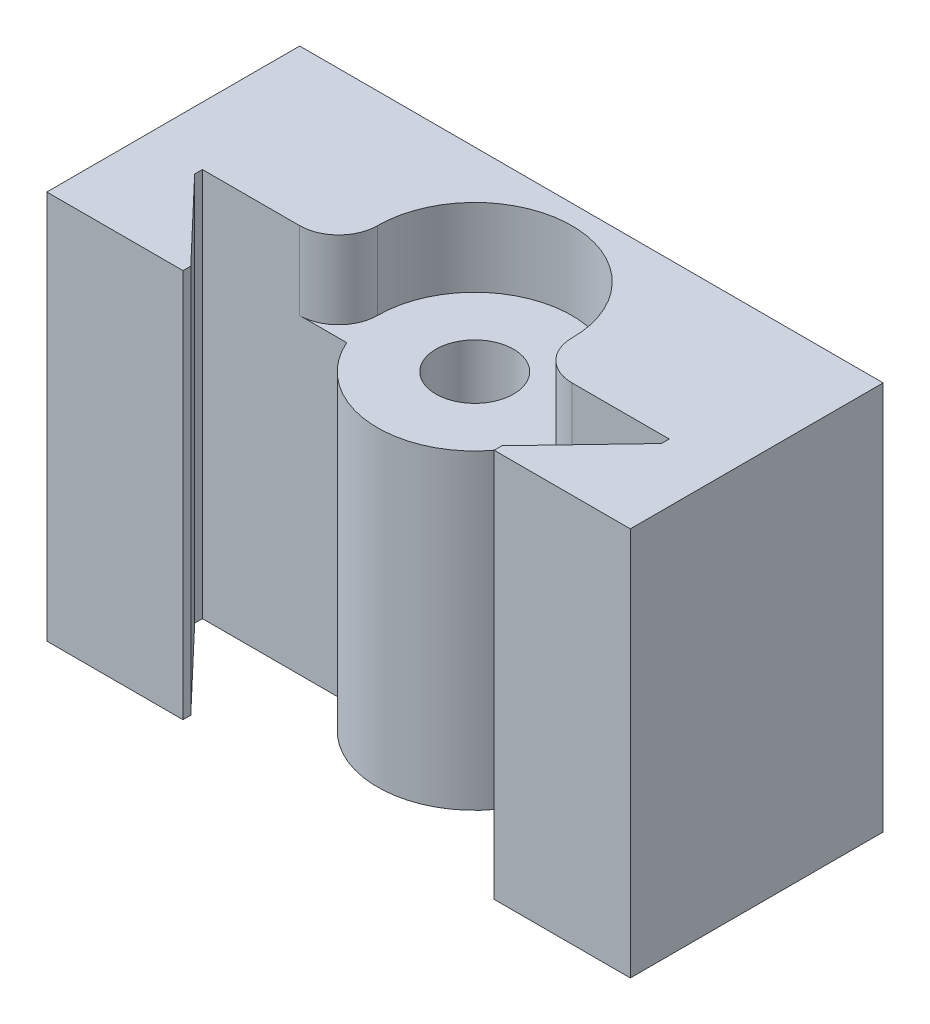
ISO-10303-21;
HEADER;
FILE_DESCRIPTION(('STEP AP214'),'2;1');
FILE_NAME('part.step','',(''),(''),'','','');
FILE_SCHEMA(('AUTOMOTIVE_DESIGN { 1 0 10303 214 1 1 1 1 }'));
ENDSEC;
DATA;
#1=APPLICATION_CONTEXT('core data for automotive mechanical design processes');
#2=APPLICATION_PROTOCOL_DEFINITION('international standard','automotive_design',2000,#1);
#3=PRODUCT_CONTEXT('',#1,'mechanical');
#4=PRODUCT('Part','Part','',(#3));
#5=PRODUCT_RELATED_PRODUCT_CATEGORY('part','',(#4));
#6=PRODUCT_DEFINITION_FORMATION('','',#4);
#7=PRODUCT_DEFINITION_CONTEXT('part definition',#1,'design');
#8=PRODUCT_DEFINITION('design','',#6,#7);
#9=PRODUCT_DEFINITION_SHAPE('','',#8);
#10=(LENGTH_UNIT() NAMED_UNIT(*) SI_UNIT(.MILLI.,.METRE.));
#11=(NAMED_UNIT(*) PLANE_ANGLE_UNIT() SI_UNIT($,.RADIAN.));
#12=(NAMED_UNIT(*) SI_UNIT($,.STERADIAN.) SOLID_ANGLE_UNIT());
#13=UNCERTAINTY_MEASURE_WITH_UNIT(LENGTH_MEASURE(1.E-05),#10,'distance_accuracy_value','');
#14=(GEOMETRIC_REPRESENTATION_CONTEXT(3) GLOBAL_UNCERTAINTY_ASSIGNED_CONTEXT((#13)) GLOBAL_UNIT_ASSIGNED_CONTEXT((#10,
#11,#12)) REPRESENTATION_CONTEXT('',''));
#15=CARTESIAN_POINT('',(0.,0.,0.));
#16=DIRECTION('',(0.,0.,1.));
#17=DIRECTION('',(1.,0.,0.));
#18=AXIS2_PLACEMENT_3D('',#15,#16,#17);
#19=CARTESIAN_POINT('',(7.,20.,-7.));
#20=DIRECTION('',(0.,-1.,0.));
#21=DIRECTION('',(0.,0.,-1.));
#22=AXIS2_PLACEMENT_3D('',#19,#20,#21);
#23=CYLINDRICAL_SURFACE('',#22,2.);
#24=DIRECTION('',(0.,-1.,0.));
#25=VECTOR('',#24,1.);
#26=CARTESIAN_POINT('',(5.,20.,-7.));
#27=LINE('',#26,#25);
#28=CARTESIAN_POINT('',(5.,20.,-7.));
#29=VERTEX_POINT('',#28);
#30=CARTESIAN_POINT('',(5.,16.,-7.));
#31=VERTEX_POINT('',#30);
#32=EDGE_CURVE('E64',#29,#31,#27,.T.);
#33=ORIENTED_EDGE('',*,*,#32,.T.);
#34=CARTESIAN_POINT('',(7.,16.,-7.));
#35=DIRECTION('',(0.,1.,0.));
#36=DIRECTION('',(0.,0.,1.));
#37=AXIS2_PLACEMENT_3D('',#34,#35,#36);
#38=CIRCLE('',#37,2.);
#39=CARTESIAN_POINT('',(7.,16.,-5.));
#40=VERTEX_POINT('',#39);
#41=EDGE_CURVE('E375',#31,#40,#38,.T.);
#42=ORIENTED_EDGE('',*,*,#41,.T.);
#43=DIRECTION('',(0.,-1.,0.));
#44=VECTOR('',#43,1.);
#45=CARTESIAN_POINT('',(7.,20.,-5.));
#46=LINE('',#45,#44);
#47=CARTESIAN_POINT('',(7.,20.,-5.));
#48=VERTEX_POINT('',#47);
#49=EDGE_CURVE('E11',#48,#40,#46,.T.);
#50=ORIENTED_EDGE('',*,*,#49,.F.);
#51=CARTESIAN_POINT('',(7.,20.,-7.));
#52=DIRECTION('',(0.,1.,0.));
#53=DIRECTION('',(0.,0.,1.));
#54=AXIS2_PLACEMENT_3D('',#51,#52,#53);
#55=CIRCLE('',#54,2.);
#56=EDGE_CURVE('E343',#29,#48,#55,.T.);
#57=ORIENTED_EDGE('',*,*,#56,.F.);
#58=EDGE_LOOP('',(#33,#42,#50,#57));
#59=FACE_BOUND('',#58,.T.);
#60=ADVANCED_FACE('F47',(#59),#23,.T.);
#61=CARTESIAN_POINT('',(0.,20.,-5.));
#62=DIRECTION('',(0.,0.,-1.));
#63=DIRECTION('',(-1.,0.,0.));
#64=AXIS2_PLACEMENT_3D('',#61,#62,#63);
#65=PLANE('',#64);
#66=DIRECTION('',(1.,0.,0.));
#67=VECTOR('',#66,1.);
#68=CARTESIAN_POINT('',(0.,0.,-5.));
#69=LINE('',#68,#67);
#70=CARTESIAN_POINT('',(4.58257569495584,0.,-5.));
#71=VERTEX_POINT('',#70);
#72=CARTESIAN_POINT('',(12.,0.,-5.));
#73=VERTEX_POINT('',#72);
#74=EDGE_CURVE('E197',#71,#73,#69,.T.);
#75=ORIENTED_EDGE('',*,*,#74,.T.);
#76=DIRECTION('',(0.,-1.,0.));
#77=VECTOR('',#76,1.);
#78=CARTESIAN_POINT('',(12.,20.,-5.));
#79=LINE('',#78,#77);
#80=CARTESIAN_POINT('',(12.,20.,-5.));
#81=VERTEX_POINT('',#80);
#82=EDGE_CURVE('E56',#81,#73,#79,.T.);
#83=ORIENTED_EDGE('',*,*,#82,.F.);
#84=DIRECTION('',(1.,0.,0.));
#85=VECTOR('',#84,1.);
#86=CARTESIAN_POINT('',(0.,20.,-5.));
#87=LINE('',#86,#85);
#88=EDGE_CURVE('E123',#48,#81,#87,.T.);
#89=ORIENTED_EDGE('',*,*,#88,.F.);
#90=ORIENTED_EDGE('',*,*,#49,.T.);
#91=DIRECTION('',(1.,0.,0.));
#92=VECTOR('',#91,1.);
#93=CARTESIAN_POINT('',(0.,16.,-5.));
#94=LINE('',#93,#92);
#95=CARTESIAN_POINT('',(4.58257569495584,16.,-5.));
#96=VERTEX_POINT('',#95);
#97=EDGE_CURVE('E379',#96,#40,#94,.T.);
#98=ORIENTED_EDGE('',*,*,#97,.F.);
#99=DIRECTION('',(0.,-1.,0.));
#100=VECTOR('',#99,1.);
#101=CARTESIAN_POINT('',(4.58257569495584,16.,-5.));
#102=LINE('',#101,#100);
#103=EDGE_CURVE('E201',#96,#71,#102,.T.);
#104=ORIENTED_EDGE('',*,*,#103,.T.);
#105=EDGE_LOOP('',(#75,#83,#89,#90,#98,#104));
#106=FACE_BOUND('',#105,.T.);
#107=ADVANCED_FACE('F397',(#106),#65,.F.);
#108=CARTESIAN_POINT('',(12.,20.,0.));
#109=DIRECTION('',(1.,0.,0.));
#110=DIRECTION('',(0.,0.,-1.));
#111=AXIS2_PLACEMENT_3D('',#108,#109,#110);
#112=PLANE('',#111);
#113=DIRECTION('',(0.,0.,1.));
#114=VECTOR('',#113,1.);
#115=CARTESIAN_POINT('',(12.,0.,0.));
#116=LINE('',#115,#114);
#117=CARTESIAN_POINT('',(12.,0.,-4.6));
#118=VERTEX_POINT('',#117);
#119=EDGE_CURVE('E200',#73,#118,#116,.T.);
#120=ORIENTED_EDGE('',*,*,#119,.T.);
#121=DIRECTION('',(0.,-1.,0.));
#122=VECTOR('',#121,1.);
#123=CARTESIAN_POINT('',(12.,20.,-4.6));
#124=LINE('',#123,#122);
#125=CARTESIAN_POINT('',(12.,20.,-4.6));
#126=VERTEX_POINT('',#125);
#127=EDGE_CURVE('E277',#126,#118,#124,.T.);
#128=ORIENTED_EDGE('',*,*,#127,.F.);
#129=DIRECTION('',(0.,0.,1.));
#130=VECTOR('',#129,1.);
#131=CARTESIAN_POINT('',(12.,20.,0.));
#132=LINE('',#131,#130);
#133=EDGE_CURVE('E287',#81,#126,#132,.T.);
#134=ORIENTED_EDGE('',*,*,#133,.F.);
#135=ORIENTED_EDGE('',*,*,#82,.T.);
#136=EDGE_LOOP('',(#120,#128,#134,#135));
#137=FACE_BOUND('',#136,.T.);
#138=ADVANCED_FACE('F285',(#137),#112,.F.);
#139=CARTESIAN_POINT('',(3.99524375743163,20.,3.80499405469679));
#140=DIRECTION('',(0.724137931034483,0.,0.689655172413793));
#141=DIRECTION('',(0.689655172413793,0.,-0.724137931034483));
#142=AXIS2_PLACEMENT_3D('',#139,#140,#141);
#143=PLANE('',#142);
#144=DIRECTION('',(-0.689655172413793,0.,0.724137931034483));
#145=VECTOR('',#144,1.);
#146=CARTESIAN_POINT('',(3.99524375743163,0.,3.80499405469679));
#147=LINE('',#146,#145);
#148=CARTESIAN_POINT('',(8.,0.,-0.399999999999999));
#149=VERTEX_POINT('',#148);
#150=EDGE_CURVE('E205',#118,#149,#147,.T.);
#151=ORIENTED_EDGE('',*,*,#150,.T.);
#152=DIRECTION('',(0.,-1.,0.));
#153=VECTOR('',#152,1.);
#154=CARTESIAN_POINT('',(8.,20.,-0.399999999999999));
#155=LINE('',#154,#153);
#156=CARTESIAN_POINT('',(8.,20.,-0.399999999999999));
#157=VERTEX_POINT('',#156);
#158=EDGE_CURVE('E274',#157,#149,#155,.T.);
#159=ORIENTED_EDGE('',*,*,#158,.F.);
#160=DIRECTION('',(-0.689655172413793,0.,0.724137931034483));
#161=VECTOR('',#160,1.);
#162=CARTESIAN_POINT('',(3.99524375743163,20.,3.80499405469679));
#163=LINE('',#162,#161);
#164=EDGE_CURVE('E303',#126,#157,#163,.T.);
#165=ORIENTED_EDGE('',*,*,#164,.F.);
#166=ORIENTED_EDGE('',*,*,#127,.T.);
#167=EDGE_LOOP('',(#151,#159,#165,#166));
#168=FACE_BOUND('',#167,.T.);
#169=ADVANCED_FACE('F300',(#168),#143,.F.);
#170=CARTESIAN_POINT('',(8.,20.,0.));
#171=DIRECTION('',(-1.,0.,0.));
#172=DIRECTION('',(0.,0.,1.));
#173=AXIS2_PLACEMENT_3D('',#170,#171,#172);
#174=PLANE('',#173);
#175=DIRECTION('',(0.,0.,-1.));
#176=VECTOR('',#175,1.);
#177=CARTESIAN_POINT('',(8.,0.,0.));
#178=LINE('',#177,#176);
#179=CARTESIAN_POINT('',(8.,0.,0.));
#180=VERTEX_POINT('',#179);
#181=EDGE_CURVE('E209',#180,#149,#178,.T.);
#182=ORIENTED_EDGE('',*,*,#181,.F.);
#183=DIRECTION('',(0.,-1.,0.));
#184=VECTOR('',#183,1.);
#185=CARTESIAN_POINT('',(8.,20.,0.));
#186=LINE('',#185,#184);
#187=CARTESIAN_POINT('',(8.,20.,0.));
#188=VERTEX_POINT('',#187);
#189=EDGE_CURVE('E271',#188,#180,#186,.T.);
#190=ORIENTED_EDGE('',*,*,#189,.F.);
#191=DIRECTION('',(0.,0.,-1.));
#192=VECTOR('',#191,1.);
#193=CARTESIAN_POINT('',(8.,20.,0.));
#194=LINE('',#193,#192);
#195=EDGE_CURVE('E306',#188,#157,#194,.T.);
#196=ORIENTED_EDGE('',*,*,#195,.T.);
#197=ORIENTED_EDGE('',*,*,#158,.T.);
#198=EDGE_LOOP('',(#182,#190,#196,#197));
#199=FACE_BOUND('',#198,.T.);
#200=ADVANCED_FACE('F452',(#199),#174,.T.);
#201=CARTESIAN_POINT('',(0.,20.,0.));
#202=DIRECTION('',(0.,0.,-1.));
#203=DIRECTION('',(-1.,0.,0.));
#204=AXIS2_PLACEMENT_3D('',#201,#202,#203);
#205=PLANE('',#204);
#206=DIRECTION('',(1.,0.,0.));
#207=VECTOR('',#206,1.);
#208=CARTESIAN_POINT('',(0.,0.,0.));
#209=LINE('',#208,#207);
#210=CARTESIAN_POINT('',(15.,0.,0.));
#211=VERTEX_POINT('',#210);
#212=EDGE_CURVE('E213',#180,#211,#209,.T.);
#213=ORIENTED_EDGE('',*,*,#212,.T.);
#214=DIRECTION('',(0.,-1.,0.));
#215=VECTOR('',#214,1.);
#216=CARTESIAN_POINT('',(15.,20.,0.));
#217=LINE('',#216,#215);
#218=CARTESIAN_POINT('',(15.,20.,0.));
#219=VERTEX_POINT('',#218);
#220=EDGE_CURVE('E267',#219,#211,#217,.T.);
#221=ORIENTED_EDGE('',*,*,#220,.F.);
#222=DIRECTION('',(1.,0.,0.));
#223=VECTOR('',#222,1.);
#224=CARTESIAN_POINT('',(0.,20.,0.));
#225=LINE('',#224,#223);
#226=EDGE_CURVE('E310',#188,#219,#225,.T.);
#227=ORIENTED_EDGE('',*,*,#226,.F.);
#228=ORIENTED_EDGE('',*,*,#189,.T.);
#229=EDGE_LOOP('',(#213,#221,#227,#228));
#230=FACE_BOUND('',#229,.T.);
#231=ADVANCED_FACE('F448',(#230),#205,.F.);
#232=CARTESIAN_POINT('',(15.,20.,0.));
#233=DIRECTION('',(-1.,0.,0.));
#234=DIRECTION('',(0.,0.,1.));
#235=AXIS2_PLACEMENT_3D('',#232,#233,#234);
#236=PLANE('',#235);
#237=DIRECTION('',(0.,0.,-1.));
#238=VECTOR('',#237,1.);
#239=CARTESIAN_POINT('',(15.,0.,0.));
#240=LINE('',#239,#238);
#241=CARTESIAN_POINT('',(15.,0.,-13.));
#242=VERTEX_POINT('',#241);
#243=EDGE_CURVE('E216',#211,#242,#240,.T.);
#244=ORIENTED_EDGE('',*,*,#243,.T.);
#245=DIRECTION('',(0.,-1.,0.));
#246=VECTOR('',#245,1.);
#247=CARTESIAN_POINT('',(15.,20.,-13.));
#248=LINE('',#247,#246);
#249=CARTESIAN_POINT('',(15.,20.,-13.));
#250=VERTEX_POINT('',#249);
#251=EDGE_CURVE('E263',#250,#242,#248,.T.);
#252=ORIENTED_EDGE('',*,*,#251,.F.);
#253=DIRECTION('',(0.,0.,-1.));
#254=VECTOR('',#253,1.);
#255=CARTESIAN_POINT('',(15.,20.,0.));
#256=LINE('',#255,#254);
#257=EDGE_CURVE('E316',#219,#250,#256,.T.);
#258=ORIENTED_EDGE('',*,*,#257,.F.);
#259=ORIENTED_EDGE('',*,*,#220,.T.);
#260=EDGE_LOOP('',(#244,#252,#258,#259));
#261=FACE_BOUND('',#260,.T.);
#262=ADVANCED_FACE('F444',(#261),#236,.F.);
#263=CARTESIAN_POINT('',(0.,20.,-13.));
#264=DIRECTION('',(0.,0.,1.));
#265=DIRECTION('',(1.,0.,0.));
#266=AXIS2_PLACEMENT_3D('',#263,#264,#265);
#267=PLANE('',#266);
#268=DIRECTION('',(-1.,0.,0.));
#269=VECTOR('',#268,1.);
#270=CARTESIAN_POINT('',(0.,0.,-13.));
#271=LINE('',#270,#269);
#272=CARTESIAN_POINT('',(-15.,0.,-13.));
#273=VERTEX_POINT('',#272);
#274=EDGE_CURVE('E219',#242,#273,#271,.T.);
#275=ORIENTED_EDGE('',*,*,#274,.T.);
#276=DIRECTION('',(0.,-1.,0.));
#277=VECTOR('',#276,1.);
#278=CARTESIAN_POINT('',(-15.,20.,-13.));
#279=LINE('',#278,#277);
#280=CARTESIAN_POINT('',(-15.,20.,-13.));
#281=VERTEX_POINT('',#280);
#282=EDGE_CURVE('E260',#281,#273,#279,.T.);
#283=ORIENTED_EDGE('',*,*,#282,.F.);
#284=DIRECTION('',(-1.,0.,0.));
#285=VECTOR('',#284,1.);
#286=CARTESIAN_POINT('',(0.,20.,-13.));
#287=LINE('',#286,#285);
#288=EDGE_CURVE('E319',#250,#281,#287,.T.);
#289=ORIENTED_EDGE('',*,*,#288,.F.);
#290=ORIENTED_EDGE('',*,*,#251,.T.);
#291=EDGE_LOOP('',(#275,#283,#289,#290));
#292=FACE_BOUND('',#291,.T.);
#293=ADVANCED_FACE('F440',(#292),#267,.F.);
#294=CARTESIAN_POINT('',(-15.,20.,0.));
#295=DIRECTION('',(-1.,0.,0.));
#296=DIRECTION('',(0.,0.,1.));
#297=AXIS2_PLACEMENT_3D('',#294,#295,#296);
#298=PLANE('',#297);
#299=DIRECTION('',(0.,0.,-1.));
#300=VECTOR('',#299,1.);
#301=CARTESIAN_POINT('',(-15.,0.,0.));
#302=LINE('',#301,#300);
#303=CARTESIAN_POINT('',(-15.,0.,0.));
#304=VERTEX_POINT('',#303);
#305=EDGE_CURVE('E223',#304,#273,#302,.T.);
#306=ORIENTED_EDGE('',*,*,#305,.F.);
#307=DIRECTION('',(0.,-1.,0.));
#308=VECTOR('',#307,1.);
#309=CARTESIAN_POINT('',(-15.,20.,0.));
#310=LINE('',#309,#308);
#311=CARTESIAN_POINT('',(-15.,20.,0.));
#312=VERTEX_POINT('',#311);
#313=EDGE_CURVE('E257',#312,#304,#310,.T.);
#314=ORIENTED_EDGE('',*,*,#313,.F.);
#315=DIRECTION('',(0.,0.,-1.));
#316=VECTOR('',#315,1.);
#317=CARTESIAN_POINT('',(-15.,20.,0.));
#318=LINE('',#317,#316);
#319=EDGE_CURVE('E322',#312,#281,#318,.T.);
#320=ORIENTED_EDGE('',*,*,#319,.T.);
#321=ORIENTED_EDGE('',*,*,#282,.T.);
#322=EDGE_LOOP('',(#306,#314,#320,#321));
#323=FACE_BOUND('',#322,.T.);
#324=ADVANCED_FACE('F436',(#323),#298,.T.);
#325=CARTESIAN_POINT('',(0.,20.,0.));
#326=DIRECTION('',(0.,0.,1.));
#327=DIRECTION('',(1.,0.,0.));
#328=AXIS2_PLACEMENT_3D('',#325,#326,#327);
#329=PLANE('',#328);
#330=DIRECTION('',(-1.,0.,0.));
#331=VECTOR('',#330,1.);
#332=CARTESIAN_POINT('',(0.,0.,0.));
#333=LINE('',#332,#331);
#334=CARTESIAN_POINT('',(-8.,0.,0.));
#335=VERTEX_POINT('',#334);
#336=EDGE_CURVE('E227',#335,#304,#333,.T.);
#337=ORIENTED_EDGE('',*,*,#336,.F.);
#338=DIRECTION('',(0.,-1.,0.));
#339=VECTOR('',#338,1.);
#340=CARTESIAN_POINT('',(-8.,20.,0.));
#341=LINE('',#340,#339);
#342=CARTESIAN_POINT('',(-8.,20.,0.));
#343=VERTEX_POINT('',#342);
#344=EDGE_CURVE('E254',#343,#335,#341,.T.);
#345=ORIENTED_EDGE('',*,*,#344,.F.);
#346=DIRECTION('',(-1.,0.,0.));
#347=VECTOR('',#346,1.);
#348=CARTESIAN_POINT('',(0.,20.,0.));
#349=LINE('',#348,#347);
#350=EDGE_CURVE('E326',#343,#312,#349,.T.);
#351=ORIENTED_EDGE('',*,*,#350,.T.);
#352=ORIENTED_EDGE('',*,*,#313,.T.);
#353=EDGE_LOOP('',(#337,#345,#351,#352));
#354=FACE_BOUND('',#353,.T.);
#355=ADVANCED_FACE('F432',(#354),#329,.T.);
#356=CARTESIAN_POINT('',(-8.,20.,0.));
#357=DIRECTION('',(-1.,0.,0.));
#358=DIRECTION('',(0.,0.,1.));
#359=AXIS2_PLACEMENT_3D('',#356,#357,#358);
#360=PLANE('',#359);
#361=DIRECTION('',(0.,0.,-1.));
#362=VECTOR('',#361,1.);
#363=CARTESIAN_POINT('',(-8.,0.,0.));
#364=LINE('',#363,#362);
#365=CARTESIAN_POINT('',(-8.,0.,-0.399999999999999));
#366=VERTEX_POINT('',#365);
#367=EDGE_CURVE('E231',#335,#366,#364,.T.);
#368=ORIENTED_EDGE('',*,*,#367,.T.);
#369=DIRECTION('',(0.,-1.,0.));
#370=VECTOR('',#369,1.);
#371=CARTESIAN_POINT('',(-8.,20.,-0.399999999999999));
#372=LINE('',#371,#370);
#373=CARTESIAN_POINT('',(-8.,20.,-0.399999999999999));
#374=VERTEX_POINT('',#373);
#375=EDGE_CURVE('E251',#374,#366,#372,.T.);
#376=ORIENTED_EDGE('',*,*,#375,.F.);
#377=DIRECTION('',(0.,0.,-1.));
#378=VECTOR('',#377,1.);
#379=CARTESIAN_POINT('',(-8.,20.,0.));
#380=LINE('',#379,#378);
#381=EDGE_CURVE('E330',#343,#374,#380,.T.);
#382=ORIENTED_EDGE('',*,*,#381,.F.);
#383=ORIENTED_EDGE('',*,*,#344,.T.);
#384=EDGE_LOOP('',(#368,#376,#382,#383));
#385=FACE_BOUND('',#384,.T.);
#386=ADVANCED_FACE('F427',(#385),#360,.F.);
#387=CARTESIAN_POINT('',(-3.99524375743163,20.,3.80499405469679));
#388=DIRECTION('',(0.724137931034483,0.,-0.689655172413793));
#389=DIRECTION('',(-0.689655172413793,0.,-0.724137931034483));
#390=AXIS2_PLACEMENT_3D('',#387,#388,#389);
#391=PLANE('',#390);
#392=DIRECTION('',(0.689655172413793,0.,0.724137931034483));
#393=VECTOR('',#392,1.);
#394=CARTESIAN_POINT('',(-3.99524375743163,0.,3.80499405469679));
#395=LINE('',#394,#393);
#396=CARTESIAN_POINT('',(-12.,0.,-4.6));
#397=VERTEX_POINT('',#396);
#398=EDGE_CURVE('E235',#397,#366,#395,.T.);
#399=ORIENTED_EDGE('',*,*,#398,.F.);
#400=DIRECTION('',(0.,-1.,0.));
#401=VECTOR('',#400,1.);
#402=CARTESIAN_POINT('',(-12.,20.,-4.6));
#403=LINE('',#402,#401);
#404=CARTESIAN_POINT('',(-12.,20.,-4.6));
#405=VERTEX_POINT('',#404);
#406=EDGE_CURVE('E107',#405,#397,#403,.T.);
#407=ORIENTED_EDGE('',*,*,#406,.F.);
#408=DIRECTION('',(0.689655172413793,0.,0.724137931034483));
#409=VECTOR('',#408,1.);
#410=CARTESIAN_POINT('',(-3.99524375743163,20.,3.80499405469679));
#411=LINE('',#410,#409);
#412=EDGE_CURVE('E332',#405,#374,#411,.T.);
#413=ORIENTED_EDGE('',*,*,#412,.T.);
#414=ORIENTED_EDGE('',*,*,#375,.T.);
#415=EDGE_LOOP('',(#399,#407,#413,#414));
#416=FACE_BOUND('',#415,.T.);
#417=ADVANCED_FACE('F423',(#416),#391,.T.);
#418=CARTESIAN_POINT('',(-12.,20.,0.));
#419=DIRECTION('',(1.,0.,0.));
#420=DIRECTION('',(0.,0.,-1.));
#421=AXIS2_PLACEMENT_3D('',#418,#419,#420);
#422=PLANE('',#421);
#423=DIRECTION('',(0.,0.,1.));
#424=VECTOR('',#423,1.);
#425=CARTESIAN_POINT('',(-12.,0.,0.));
#426=LINE('',#425,#424);
#427=CARTESIAN_POINT('',(-12.,0.,-5.));
#428=VERTEX_POINT('',#427);
#429=EDGE_CURVE('E239',#428,#397,#426,.T.);
#430=ORIENTED_EDGE('',*,*,#429,.F.);
#431=DIRECTION('',(0.,-1.,0.));
#432=VECTOR('',#431,1.);
#433=CARTESIAN_POINT('',(-12.,20.,-5.));
#434=LINE('',#433,#432);
#435=CARTESIAN_POINT('',(-12.,20.,-5.));
#436=VERTEX_POINT('',#435);
#437=EDGE_CURVE('E115',#436,#428,#434,.T.);
#438=ORIENTED_EDGE('',*,*,#437,.F.);
#439=DIRECTION('',(0.,0.,1.));
#440=VECTOR('',#439,1.);
#441=CARTESIAN_POINT('',(-12.,20.,0.));
#442=LINE('',#441,#440);
#443=EDGE_CURVE('E171',#436,#405,#442,.T.);
#444=ORIENTED_EDGE('',*,*,#443,.T.);
#445=ORIENTED_EDGE('',*,*,#406,.T.);
#446=EDGE_LOOP('',(#430,#438,#444,#445));
#447=FACE_BOUND('',#446,.T.);
#448=ADVANCED_FACE('F337',(#447),#422,.T.);
#449=CARTESIAN_POINT('',(-4.58257569495584,0.,-5.));
#450=VERTEX_POINT('',#449);
#451=EDGE_CURVE('E202',#428,#450,#69,.T.);
#452=ORIENTED_EDGE('',*,*,#451,.T.);
#453=DIRECTION('',(0.,-1.,0.));
#454=VECTOR('',#453,1.);
#455=CARTESIAN_POINT('',(-4.58257569495584,16.,-5.));
#456=LINE('',#455,#454);
#457=CARTESIAN_POINT('',(-4.58257569495584,16.,-5.));
#458=VERTEX_POINT('',#457);
#459=EDGE_CURVE('E351',#458,#450,#456,.T.);
#460=ORIENTED_EDGE('',*,*,#459,.F.);
#461=DIRECTION('',(1.,0.,0.));
#462=VECTOR('',#461,1.);
#463=CARTESIAN_POINT('',(0.,16.,-5.));
#464=LINE('',#463,#462);
#465=CARTESIAN_POINT('',(-7.,16.,-5.));
#466=VERTEX_POINT('',#465);
#467=EDGE_CURVE('E181',#466,#458,#464,.T.);
#468=ORIENTED_EDGE('',*,*,#467,.F.);
#469=DIRECTION('',(0.,-1.,0.));
#470=VECTOR('',#469,1.);
#471=CARTESIAN_POINT('',(-7.,20.,-5.));
#472=LINE('',#471,#470);
#473=CARTESIAN_POINT('',(-7.,20.,-5.));
#474=VERTEX_POINT('',#473);
#475=EDGE_CURVE('E176',#474,#466,#472,.T.);
#476=ORIENTED_EDGE('',*,*,#475,.F.);
#477=EDGE_CURVE('E164',#436,#474,#87,.T.);
#478=ORIENTED_EDGE('',*,*,#477,.F.);
#479=ORIENTED_EDGE('',*,*,#437,.T.);
#480=EDGE_LOOP('',(#452,#460,#468,#476,#478,#479));
#481=FACE_BOUND('',#480,.T.);
#482=ADVANCED_FACE('F177',(#481),#65,.F.);
#483=CARTESIAN_POINT('',(-7.,20.,-7.));
#484=DIRECTION('',(0.,-1.,0.));
#485=DIRECTION('',(0.,0.,-1.));
#486=AXIS2_PLACEMENT_3D('',#483,#484,#485);
#487=CYLINDRICAL_SURFACE('',#486,2.);
#488=CARTESIAN_POINT('',(-7.,16.,-7.));
#489=DIRECTION('',(0.,1.,0.));
#490=DIRECTION('',(0.,0.,1.));
#491=AXIS2_PLACEMENT_3D('',#488,#489,#490);
#492=CIRCLE('',#491,2.);
#493=CARTESIAN_POINT('',(-5.,16.,-7.));
#494=VERTEX_POINT('',#493);
#495=EDGE_CURVE('E367',#494,#466,#492,.F.);
#496=ORIENTED_EDGE('',*,*,#495,.F.);
#497=DIRECTION('',(0.,-1.,0.));
#498=VECTOR('',#497,1.);
#499=CARTESIAN_POINT('',(-5.,20.,-7.));
#500=LINE('',#499,#498);
#501=CARTESIAN_POINT('',(-5.,20.,-7.));
#502=VERTEX_POINT('',#501);
#503=EDGE_CURVE('E185',#502,#494,#500,.T.);
#504=ORIENTED_EDGE('',*,*,#503,.F.);
#505=CARTESIAN_POINT('',(-7.,20.,-7.));
#506=DIRECTION('',(0.,1.,0.));
#507=DIRECTION('',(0.,0.,1.));
#508=AXIS2_PLACEMENT_3D('',#505,#506,#507);
#509=CIRCLE('',#508,2.);
#510=EDGE_CURVE('E169',#502,#474,#509,.F.);
#511=ORIENTED_EDGE('',*,*,#510,.T.);
#512=ORIENTED_EDGE('',*,*,#475,.T.);
#513=EDGE_LOOP('',(#496,#504,#511,#512));
#514=FACE_BOUND('',#513,.T.);
#515=ADVANCED_FACE('F187',(#514),#487,.T.);
#516=CARTESIAN_POINT('',(0.,20.,-7.));
#517=DIRECTION('',(0.,-1.,0.));
#518=DIRECTION('',(0.,0.,-1.));
#519=AXIS2_PLACEMENT_3D('',#516,#517,#518);
#520=CYLINDRICAL_SURFACE('',#519,5.);
#521=CARTESIAN_POINT('',(0.,16.,-7.));
#522=DIRECTION('',(0.,1.,0.));
#523=DIRECTION('',(0.,0.,1.));
#524=AXIS2_PLACEMENT_3D('',#521,#522,#523);
#525=CIRCLE('',#524,5.);
#526=EDGE_CURVE('E371',#31,#494,#525,.T.);
#527=ORIENTED_EDGE('',*,*,#526,.F.);
#528=ORIENTED_EDGE('',*,*,#32,.F.);
#529=CARTESIAN_POINT('',(0.,20.,-7.));
#530=DIRECTION('',(0.,1.,0.));
#531=DIRECTION('',(0.,0.,1.));
#532=AXIS2_PLACEMENT_3D('',#529,#530,#531);
#533=CIRCLE('',#532,5.);
#534=EDGE_CURVE('E190',#29,#502,#533,.T.);
#535=ORIENTED_EDGE('',*,*,#534,.T.);
#536=ORIENTED_EDGE('',*,*,#503,.T.);
#537=EDGE_LOOP('',(#527,#528,#535,#536));
#538=FACE_BOUND('',#537,.T.);
#539=ADVANCED_FACE('F406',(#538),#520,.F.);
#540=CARTESIAN_POINT('',(0.,20.,0.));
#541=DIRECTION('',(0.,1.,0.));
#542=DIRECTION('',(0.,0.,1.));
#543=AXIS2_PLACEMENT_3D('',#540,#541,#542);
#544=PLANE('',#543);
#545=ORIENTED_EDGE('',*,*,#56,.T.);
#546=ORIENTED_EDGE('',*,*,#88,.T.);
#547=ORIENTED_EDGE('',*,*,#133,.T.);
#548=ORIENTED_EDGE('',*,*,#164,.T.);
#549=ORIENTED_EDGE('',*,*,#195,.F.);
#550=ORIENTED_EDGE('',*,*,#226,.T.);
#551=ORIENTED_EDGE('',*,*,#257,.T.);
#552=ORIENTED_EDGE('',*,*,#288,.T.);
#553=ORIENTED_EDGE('',*,*,#319,.F.);
#554=ORIENTED_EDGE('',*,*,#350,.F.);
#555=ORIENTED_EDGE('',*,*,#381,.T.);
#556=ORIENTED_EDGE('',*,*,#412,.F.);
#557=ORIENTED_EDGE('',*,*,#443,.F.);
#558=ORIENTED_EDGE('',*,*,#477,.T.);
#559=ORIENTED_EDGE('',*,*,#510,.F.);
#560=ORIENTED_EDGE('',*,*,#534,.F.);
#561=EDGE_LOOP('',(#545,#546,#547,#548,#549,#550,#551,#552,#553,#554,#555,#556,#557,#558,#559,#560));
#562=FACE_BOUND('',#561,.T.);
#563=ADVANCED_FACE('F166',(#562),#544,.T.);
#564=CARTESIAN_POINT('',(0.,0.,0.));
#565=DIRECTION('',(0.,1.,0.));
#566=DIRECTION('',(0.,0.,1.));
#567=AXIS2_PLACEMENT_3D('',#564,#565,#566);
#568=PLANE('',#567);
#569=ORIENTED_EDGE('',*,*,#74,.F.);
#570=CARTESIAN_POINT('',(0.,0.,-7.));
#571=DIRECTION('',(0.,1.,0.));
#572=DIRECTION('',(0.,0.,1.));
#573=AXIS2_PLACEMENT_3D('',#570,#571,#572);
#574=CIRCLE('',#573,5.);
#575=EDGE_CURVE('E340',#450,#71,#574,.T.);
#576=ORIENTED_EDGE('',*,*,#575,.F.);
#577=ORIENTED_EDGE('',*,*,#451,.F.);
#578=ORIENTED_EDGE('',*,*,#429,.T.);
#579=ORIENTED_EDGE('',*,*,#398,.T.);
#580=ORIENTED_EDGE('',*,*,#367,.F.);
#581=ORIENTED_EDGE('',*,*,#336,.T.);
#582=ORIENTED_EDGE('',*,*,#305,.T.);
#583=ORIENTED_EDGE('',*,*,#274,.F.);
#584=ORIENTED_EDGE('',*,*,#243,.F.);
#585=ORIENTED_EDGE('',*,*,#212,.F.);
#586=ORIENTED_EDGE('',*,*,#181,.T.);
#587=ORIENTED_EDGE('',*,*,#150,.F.);
#588=ORIENTED_EDGE('',*,*,#119,.F.);
#589=EDGE_LOOP('',(#569,#576,#577,#578,#579,#580,#581,#582,#583,#584,#585,#586,#587,#588));
#590=FACE_BOUND('',#589,.T.);
#591=CARTESIAN_POINT('',(0.,0.,-7.));
#592=DIRECTION('',(0.,1.,0.));
#593=DIRECTION('',(0.,0.,1.));
#594=AXIS2_PLACEMENT_3D('',#591,#592,#593);
#595=CIRCLE('',#594,2.);
#596=CARTESIAN_POINT('',(0.,0.,-5.));
#597=VERTEX_POINT('',#596);
#598=EDGE_CURVE('E355',#597,#597,#595,.T.);
#599=ORIENTED_EDGE('',*,*,#598,.T.);
#600=EDGE_LOOP('',(#599));
#601=FACE_BOUND('',#600,.T.);
#602=ADVANCED_FACE('F291',(#590,#601),#568,.F.);
#603=CARTESIAN_POINT('',(0.,16.,-7.));
#604=DIRECTION('',(0.,-1.,0.));
#605=DIRECTION('',(0.,0.,-1.));
#606=AXIS2_PLACEMENT_3D('',#603,#604,#605);
#607=CYLINDRICAL_SURFACE('',#606,5.);
#608=ORIENTED_EDGE('',*,*,#575,.T.);
#609=ORIENTED_EDGE('',*,*,#103,.F.);
#610=CARTESIAN_POINT('',(0.,16.,-7.));
#611=DIRECTION('',(0.,1.,0.));
#612=DIRECTION('',(0.,0.,1.));
#613=AXIS2_PLACEMENT_3D('',#610,#611,#612);
#614=CIRCLE('',#613,5.);
#615=EDGE_CURVE('E359',#458,#96,#614,.T.);
#616=ORIENTED_EDGE('',*,*,#615,.F.);
#617=ORIENTED_EDGE('',*,*,#459,.T.);
#618=EDGE_LOOP('',(#608,#609,#616,#617));
#619=FACE_BOUND('',#618,.T.);
#620=ADVANCED_FACE('F396',(#619),#607,.T.);
#621=CARTESIAN_POINT('',(0.,16.,-7.));
#622=DIRECTION('',(0.,-1.,0.));
#623=DIRECTION('',(0.,0.,-1.));
#624=AXIS2_PLACEMENT_3D('',#621,#622,#623);
#625=CYLINDRICAL_SURFACE('',#624,2.);
#626=CARTESIAN_POINT('',(0.,16.,-7.));
#627=DIRECTION('',(0.,1.,0.));
#628=DIRECTION('',(0.,0.,1.));
#629=AXIS2_PLACEMENT_3D('',#626,#627,#628);
#630=CIRCLE('',#629,2.);
#631=CARTESIAN_POINT('',(0.,16.,-5.));
#632=VERTEX_POINT('',#631);
#633=EDGE_CURVE('E354',#632,#632,#630,.T.);
#634=ORIENTED_EDGE('',*,*,#633,.T.);
#635=EDGE_LOOP('',(#634));
#636=FACE_BOUND('',#635,.T.);
#637=ORIENTED_EDGE('',*,*,#598,.F.);
#638=EDGE_LOOP('',(#637));
#639=FACE_BOUND('',#638,.T.);
#640=ADVANCED_FACE('F605',(#636,#639),#625,.F.);
#641=CARTESIAN_POINT('',(0.,16.,0.));
#642=DIRECTION('',(0.,1.,0.));
#643=DIRECTION('',(0.,0.,1.));
#644=AXIS2_PLACEMENT_3D('',#641,#642,#643);
#645=PLANE('',#644);
#646=ORIENTED_EDGE('',*,*,#615,.T.);
#647=ORIENTED_EDGE('',*,*,#97,.T.);
#648=ORIENTED_EDGE('',*,*,#41,.F.);
#649=ORIENTED_EDGE('',*,*,#526,.T.);
#650=ORIENTED_EDGE('',*,*,#495,.T.);
#651=ORIENTED_EDGE('',*,*,#467,.T.);
#652=EDGE_LOOP('',(#646,#647,#648,#649,#650,#651));
#653=FACE_BOUND('',#652,.T.);
#654=ORIENTED_EDGE('',*,*,#633,.F.);
#655=EDGE_LOOP('',(#654));
#656=FACE_BOUND('',#655,.T.);
#657=ADVANCED_FACE('F389',(#653,#656),#645,.T.);
#658=CLOSED_SHELL('',(#60,#107,#138,#169,#200,#231,#262,#293,#324,#355,#386,#417,#448,#482,#515,
#539,#563,#602,#620,#640,#657));
#659=MANIFOLD_SOLID_BREP('B2',#658);
#660=ADVANCED_BREP_SHAPE_REPRESENTATION('',(#18,#659),#14);
#661=SHAPE_DEFINITION_REPRESENTATION(#9,#660);
ENDSEC;
END-ISO-10303-21;
